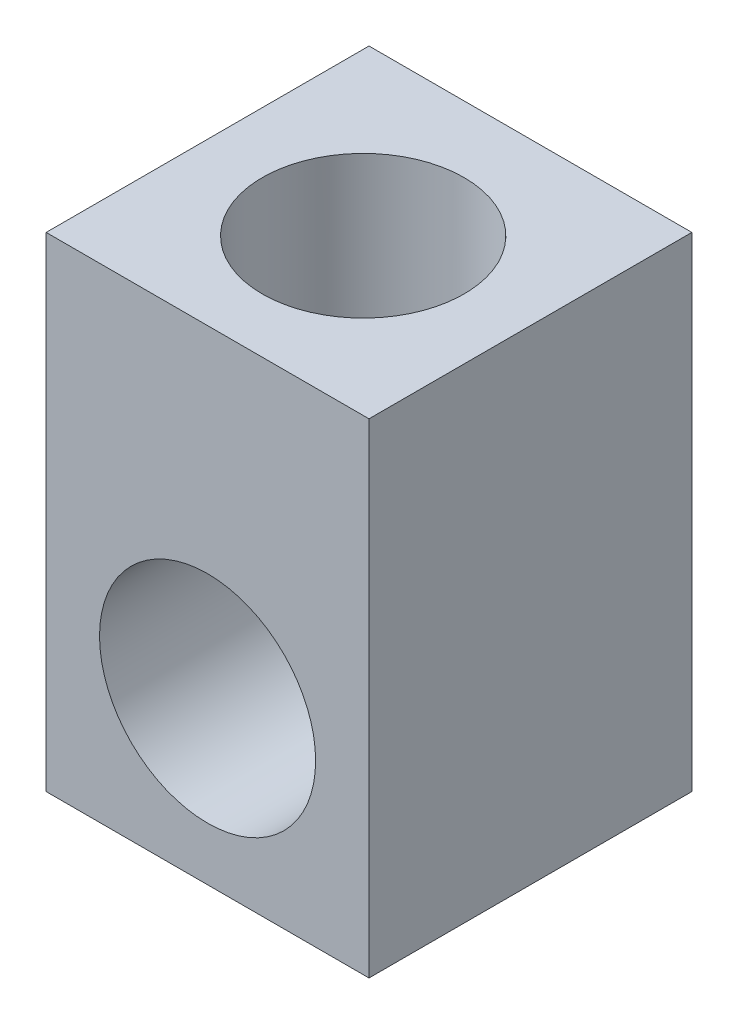
ISO-10303-21;
HEADER;
FILE_DESCRIPTION(('STEP AP214'),'2;1');
FILE_NAME('part.step','',(''),(''),'','','');
FILE_SCHEMA(('AUTOMOTIVE_DESIGN { 1 0 10303 214 1 1 1 1 }'));
ENDSEC;
DATA;
#1=APPLICATION_CONTEXT('core data for automotive mechanical design processes');
#2=APPLICATION_PROTOCOL_DEFINITION('international standard','automotive_design',2000,#1);
#3=PRODUCT_CONTEXT('',#1,'mechanical');
#4=PRODUCT('Part','Part','',(#3));
#5=PRODUCT_RELATED_PRODUCT_CATEGORY('part','',(#4));
#6=PRODUCT_DEFINITION_FORMATION('','',#4);
#7=PRODUCT_DEFINITION_CONTEXT('part definition',#1,'design');
#8=PRODUCT_DEFINITION('design','',#6,#7);
#9=PRODUCT_DEFINITION_SHAPE('','',#8);
#10=(LENGTH_UNIT() NAMED_UNIT(*) SI_UNIT(.MILLI.,.METRE.));
#11=(NAMED_UNIT(*) PLANE_ANGLE_UNIT() SI_UNIT($,.RADIAN.));
#12=(NAMED_UNIT(*) SI_UNIT($,.STERADIAN.) SOLID_ANGLE_UNIT());
#13=UNCERTAINTY_MEASURE_WITH_UNIT(LENGTH_MEASURE(1.E-05),#10,'distance_accuracy_value','');
#14=(GEOMETRIC_REPRESENTATION_CONTEXT(3) GLOBAL_UNCERTAINTY_ASSIGNED_CONTEXT((#13)) GLOBAL_UNIT_ASSIGNED_CONTEXT((#10,
#11,#12)) REPRESENTATION_CONTEXT('',''));
#15=CARTESIAN_POINT('',(0.,0.,0.));
#16=DIRECTION('',(0.,0.,1.));
#17=DIRECTION('',(1.,0.,0.));
#18=AXIS2_PLACEMENT_3D('',#15,#16,#17);
#19=CARTESIAN_POINT('',(0.,76.2,0.));
#20=DIRECTION('',(1.,0.,0.));
#21=DIRECTION('',(0.,0.,-1.));
#22=AXIS2_PLACEMENT_3D('',#19,#20,#21);
#23=PLANE('',#22);
#24=DIRECTION('',(0.,0.,1.));
#25=VECTOR('',#24,1.);
#26=CARTESIAN_POINT('',(0.,0.,0.));
#27=LINE('',#26,#25);
#28=CARTESIAN_POINT('',(0.,0.,-50.8));
#29=VERTEX_POINT('',#28);
#30=CARTESIAN_POINT('',(0.,0.,0.));
#31=VERTEX_POINT('',#30);
#32=EDGE_CURVE('E94',#29,#31,#27,.T.);
#33=ORIENTED_EDGE('',*,*,#32,.T.);
#34=DIRECTION('',(0.,-1.,0.));
#35=VECTOR('',#34,1.);
#36=CARTESIAN_POINT('',(0.,76.2,0.));
#37=LINE('',#36,#35);
#38=CARTESIAN_POINT('',(0.,76.2,0.));
#39=VERTEX_POINT('',#38);
#40=EDGE_CURVE('E11',#39,#31,#37,.T.);
#41=ORIENTED_EDGE('',*,*,#40,.F.);
#42=DIRECTION('',(0.,0.,1.));
#43=VECTOR('',#42,1.);
#44=CARTESIAN_POINT('',(0.,76.2,0.));
#45=LINE('',#44,#43);
#46=CARTESIAN_POINT('',(0.,76.2,-50.8));
#47=VERTEX_POINT('',#46);
#48=EDGE_CURVE('E82',#47,#39,#45,.T.);
#49=ORIENTED_EDGE('',*,*,#48,.F.);
#50=DIRECTION('',(0.,-1.,0.));
#51=VECTOR('',#50,1.);
#52=CARTESIAN_POINT('',(0.,76.2,-50.8));
#53=LINE('',#52,#51);
#54=EDGE_CURVE('E90',#47,#29,#53,.T.);
#55=ORIENTED_EDGE('',*,*,#54,.T.);
#56=EDGE_LOOP('',(#33,#41,#49,#55));
#57=FACE_BOUND('',#56,.T.);
#58=ADVANCED_FACE('F31',(#57),#23,.F.);
#59=CARTESIAN_POINT('',(0.,76.2,0.));
#60=DIRECTION('',(0.,0.,-1.));
#61=DIRECTION('',(-1.,0.,0.));
#62=AXIS2_PLACEMENT_3D('',#59,#60,#61);
#63=PLANE('',#62);
#64=CARTESIAN_POINT('',(25.4,25.4,0.));
#65=DIRECTION('',(0.,0.,-1.));
#66=DIRECTION('',(-1.,0.,0.));
#67=AXIS2_PLACEMENT_3D('',#64,#65,#66);
#68=CIRCLE('',#67,17.);
#69=CARTESIAN_POINT('',(8.4,25.4,0.));
#70=VERTEX_POINT('',#69);
#71=EDGE_CURVE('E97',#70,#70,#68,.T.);
#72=ORIENTED_EDGE('',*,*,#71,.T.);
#73=EDGE_LOOP('',(#72));
#74=FACE_BOUND('',#73,.T.);
#75=DIRECTION('',(1.,0.,0.));
#76=VECTOR('',#75,1.);
#77=CARTESIAN_POINT('',(0.,0.,0.));
#78=LINE('',#77,#76);
#79=CARTESIAN_POINT('',(50.8,0.,0.));
#80=VERTEX_POINT('',#79);
#81=EDGE_CURVE('E86',#31,#80,#78,.T.);
#82=ORIENTED_EDGE('',*,*,#81,.T.);
#83=DIRECTION('',(0.,-1.,0.));
#84=VECTOR('',#83,1.);
#85=CARTESIAN_POINT('',(50.8,76.2,0.));
#86=LINE('',#85,#84);
#87=CARTESIAN_POINT('',(50.8,76.2,0.));
#88=VERTEX_POINT('',#87);
#89=EDGE_CURVE('E39',#88,#80,#86,.T.);
#90=ORIENTED_EDGE('',*,*,#89,.F.);
#91=DIRECTION('',(1.,0.,0.));
#92=VECTOR('',#91,1.);
#93=CARTESIAN_POINT('',(0.,76.2,0.));
#94=LINE('',#93,#92);
#95=EDGE_CURVE('E77',#39,#88,#94,.T.);
#96=ORIENTED_EDGE('',*,*,#95,.F.);
#97=ORIENTED_EDGE('',*,*,#40,.T.);
#98=EDGE_LOOP('',(#82,#90,#96,#97));
#99=FACE_BOUND('',#98,.T.);
#100=ADVANCED_FACE('F85',(#74,#99),#63,.F.);
#101=CARTESIAN_POINT('',(50.8,76.2,0.));
#102=DIRECTION('',(-1.,0.,0.));
#103=DIRECTION('',(0.,0.,1.));
#104=AXIS2_PLACEMENT_3D('',#101,#102,#103);
#105=PLANE('',#104);
#106=DIRECTION('',(0.,0.,-1.));
#107=VECTOR('',#106,1.);
#108=CARTESIAN_POINT('',(50.8,0.,0.));
#109=LINE('',#108,#107);
#110=CARTESIAN_POINT('',(50.8,0.,-50.8));
#111=VERTEX_POINT('',#110);
#112=EDGE_CURVE('E64',#80,#111,#109,.T.);
#113=ORIENTED_EDGE('',*,*,#112,.T.);
#114=DIRECTION('',(0.,-1.,0.));
#115=VECTOR('',#114,1.);
#116=CARTESIAN_POINT('',(50.8,76.2,-50.8));
#117=LINE('',#116,#115);
#118=CARTESIAN_POINT('',(50.8,76.2,-50.8));
#119=VERTEX_POINT('',#118);
#120=EDGE_CURVE('E87',#119,#111,#117,.T.);
#121=ORIENTED_EDGE('',*,*,#120,.F.);
#122=DIRECTION('',(0.,0.,-1.));
#123=VECTOR('',#122,1.);
#124=CARTESIAN_POINT('',(50.8,76.2,0.));
#125=LINE('',#124,#123);
#126=EDGE_CURVE('E80',#88,#119,#125,.T.);
#127=ORIENTED_EDGE('',*,*,#126,.F.);
#128=ORIENTED_EDGE('',*,*,#89,.T.);
#129=EDGE_LOOP('',(#113,#121,#127,#128));
#130=FACE_BOUND('',#129,.T.);
#131=ADVANCED_FACE('F88',(#130),#105,.F.);
#132=CARTESIAN_POINT('',(0.,76.2,-50.8));
#133=DIRECTION('',(0.,0.,1.));
#134=DIRECTION('',(1.,0.,0.));
#135=AXIS2_PLACEMENT_3D('',#132,#133,#134);
#136=PLANE('',#135);
#137=CARTESIAN_POINT('',(25.4,25.4,-50.8));
#138=DIRECTION('',(0.,0.,-1.));
#139=DIRECTION('',(-1.,0.,0.));
#140=AXIS2_PLACEMENT_3D('',#137,#138,#139);
#141=CIRCLE('',#140,17.);
#142=CARTESIAN_POINT('',(8.4,25.4,-50.8));
#143=VERTEX_POINT('',#142);
#144=EDGE_CURVE('E110',#143,#143,#141,.T.);
#145=ORIENTED_EDGE('',*,*,#144,.F.);
#146=EDGE_LOOP('',(#145));
#147=FACE_BOUND('',#146,.T.);
#148=DIRECTION('',(-1.,0.,0.));
#149=VECTOR('',#148,1.);
#150=CARTESIAN_POINT('',(0.,0.,-50.8));
#151=LINE('',#150,#149);
#152=EDGE_CURVE('E70',#111,#29,#151,.T.);
#153=ORIENTED_EDGE('',*,*,#152,.T.);
#154=ORIENTED_EDGE('',*,*,#54,.F.);
#155=DIRECTION('',(-1.,0.,0.));
#156=VECTOR('',#155,1.);
#157=CARTESIAN_POINT('',(0.,76.2,-50.8));
#158=LINE('',#157,#156);
#159=EDGE_CURVE('E47',#119,#47,#158,.T.);
#160=ORIENTED_EDGE('',*,*,#159,.F.);
#161=ORIENTED_EDGE('',*,*,#120,.T.);
#162=EDGE_LOOP('',(#153,#154,#160,#161));
#163=FACE_BOUND('',#162,.T.);
#164=ADVANCED_FACE('F102',(#147,#163),#136,.F.);
#165=CARTESIAN_POINT('',(0.,76.2,-50.8));
#166=DIRECTION('',(0.,-1.,0.));
#167=DIRECTION('',(0.,0.,-1.));
#168=AXIS2_PLACEMENT_3D('',#165,#166,#167);
#169=PLANE('',#168);
#170=CARTESIAN_POINT('',(25.4,76.2,-24.4856236331401));
#171=DIRECTION('',(0.,1.,0.));
#172=DIRECTION('',(0.,0.,1.));
#173=AXIS2_PLACEMENT_3D('',#170,#171,#172);
#174=CIRCLE('',#173,15.875);
#175=CARTESIAN_POINT('',(25.4,76.2,-8.61062363314011));
#176=VERTEX_POINT('',#175);
#177=EDGE_CURVE('E113',#176,#176,#174,.T.);
#178=ORIENTED_EDGE('',*,*,#177,.F.);
#179=EDGE_LOOP('',(#178));
#180=FACE_BOUND('',#179,.T.);
#181=ORIENTED_EDGE('',*,*,#48,.T.);
#182=ORIENTED_EDGE('',*,*,#95,.T.);
#183=ORIENTED_EDGE('',*,*,#126,.T.);
#184=ORIENTED_EDGE('',*,*,#159,.T.);
#185=EDGE_LOOP('',(#181,#182,#183,#184));
#186=FACE_BOUND('',#185,.T.);
#187=ADVANCED_FACE('F78',(#180,#186),#169,.F.);
#188=CARTESIAN_POINT('',(0.,0.,-50.8));
#189=DIRECTION('',(0.,-1.,0.));
#190=DIRECTION('',(0.,0.,-1.));
#191=AXIS2_PLACEMENT_3D('',#188,#189,#190);
#192=PLANE('',#191);
#193=ORIENTED_EDGE('',*,*,#32,.F.);
#194=ORIENTED_EDGE('',*,*,#152,.F.);
#195=ORIENTED_EDGE('',*,*,#112,.F.);
#196=ORIENTED_EDGE('',*,*,#81,.F.);
#197=EDGE_LOOP('',(#193,#194,#195,#196));
#198=FACE_BOUND('',#197,.T.);
#199=ADVANCED_FACE('F105',(#198),#192,.T.);
#200=CARTESIAN_POINT('',(25.4,25.4,25.4));
#201=DIRECTION('',(0.,0.,-1.));
#202=DIRECTION('',(-1.,0.,0.));
#203=AXIS2_PLACEMENT_3D('',#200,#201,#202);
#204=CYLINDRICAL_SURFACE('',#203,17.);
#205=CARTESIAN_POINT('',(25.4,42.4,-8.61062363314011));
#206=CARTESIAN_POINT('',(25.0366266977627,42.3999989105498,-8.61062473301476));
#207=CARTESIAN_POINT('',(24.6732384414275,42.3883260528731,-8.6231229648808));
#208=CARTESIAN_POINT('',(23.9496434345601,42.3418987721633,-8.67285545206848));
#209=CARTESIAN_POINT('',(23.5894368726679,42.307142989748,-8.710091164211));
#210=CARTESIAN_POINT('',(22.8750392121792,42.2153010561053,-8.80856109902749));
#211=CARTESIAN_POINT('',(22.5208512556375,42.1582035936275,-8.8698074779641));
#212=CARTESIAN_POINT('',(21.8213369257011,42.022878871078,-9.01512179284696));
#213=CARTESIAN_POINT('',(21.4760106316715,41.9446514218382,-9.09918993310723));
#214=CARTESIAN_POINT('',(20.79861041808,41.7691438396201,-9.28806775414502));
#215=CARTESIAN_POINT('',(20.4664658649705,41.6719887638284,-9.39274133722168));
#216=CARTESIAN_POINT('',(19.8148213921091,41.4599873933943,-9.62155043903515));
#217=CARTESIAN_POINT('',(19.4953211753405,41.3451415146213,-9.74568550027946));
#218=CARTESIAN_POINT('',(18.8702073040842,41.0995091879706,-10.0117564998633));
#219=CARTESIAN_POINT('',(18.5645934377233,40.9687229834171,-10.1536921664831));
#220=CARTESIAN_POINT('',(17.968049250634,40.6929444272239,-10.4537574809384));
#221=CARTESIAN_POINT('',(17.6771223090354,40.54794882869,-10.6118908303738));
#222=CARTESIAN_POINT('',(16.9958847396493,40.1842568632254,-11.0097643023263));
#223=CARTESIAN_POINT('',(16.6129666137973,39.9594700788478,-11.2566433859677));
#224=CARTESIAN_POINT('',(15.8778000976667,39.4896481709275,-11.7755507654684));
#225=CARTESIAN_POINT('',(15.5255630326207,39.2446056349288,-12.0475882722479));
#226=CARTESIAN_POINT('',(14.8507769072314,38.7376332541857,-12.6144711956339));
#227=CARTESIAN_POINT('',(14.5283183239014,38.4756558060124,-12.9093814160569));
#228=CARTESIAN_POINT('',(13.913871259842,37.939345919268,-13.5187779208917));
#229=CARTESIAN_POINT('',(13.6218796656822,37.6650147472372,-13.8332621997707));
#230=CARTESIAN_POINT('',(12.9956438392124,37.0351555800355,-14.5641514605782));
#231=CARTESIAN_POINT('',(12.6701046982102,36.6770343818458,-14.9858235646922));
#232=CARTESIAN_POINT('',(12.216225333696,36.135164617202,-15.638369113158));
#233=CARTESIAN_POINT('',(12.0706061959393,35.95366803189,-15.8593394663386));
#234=CARTESIAN_POINT('',(11.7907398840329,35.5902208269848,-16.3079967975649));
#235=CARTESIAN_POINT('',(11.6564915015134,35.4082702577573,-16.5356830584356));
#236=CARTESIAN_POINT('',(11.3995844214461,35.045601551225,-16.9973914797502));
#237=CARTESIAN_POINT('',(11.276898582762,34.8648815008803,-17.2313970552323));
#238=CARTESIAN_POINT('',(11.0427318615341,34.5057552677662,-17.7066378211845));
#239=CARTESIAN_POINT('',(10.9312495495635,34.3273487923504,-17.9478720842551));
#240=CARTESIAN_POINT('',(10.7196440832249,33.9749252900046,-18.4379829335474));
#241=CARTESIAN_POINT('',(10.6195092418645,33.8009038931621,-18.6868513151904));
#242=CARTESIAN_POINT('',(10.4306811574177,33.4596194531848,-19.1933487170267));
#243=CARTESIAN_POINT('',(10.3419844547623,33.292354377101,-19.4509750583651));
#244=CARTESIAN_POINT('',(10.2006708343764,33.0155760069351,-19.8993507854188));
#245=CARTESIAN_POINT('',(10.1450960603904,32.9034984407005,-20.0875834593947));
#246=CARTESIAN_POINT('',(10.0400941012049,32.6861404531658,-20.4696327530224));
#247=CARTESIAN_POINT('',(9.99066688833327,32.5808600012708,-20.6634493475345));
#248=CARTESIAN_POINT('',(9.89833978163158,32.3793127151967,-21.0570744069252));
#249=CARTESIAN_POINT('',(9.8554342409515,32.2830381113254,-21.2568775067784));
#250=CARTESIAN_POINT('',(9.77658799195357,32.1021435937147,-21.6629515876947));
#251=CARTESIAN_POINT('',(9.74064601103117,32.0175215512654,-21.8692213789365));
#252=CARTESIAN_POINT('',(9.65703679216498,31.8169336470218,-22.4145062227674));
#253=CARTESIAN_POINT('',(9.61523974588825,31.7125499509462,-22.7590346320388));
#254=CARTESIAN_POINT('',(9.56943657800511,31.5963690025146,-23.2856427192451));
#255=CARTESIAN_POINT('',(9.55698822080718,31.5643861110373,-23.4626359347724));
#256=CARTESIAN_POINT('',(9.53799873338729,31.5153593179567,-23.8190410386385));
#257=CARTESIAN_POINT('',(9.53145713098429,31.4983142222417,-23.9984527324824));
#258=CARTESIAN_POINT('',(9.52446737517064,31.4800958185255,-24.3594653481544));
#259=CARTESIAN_POINT('',(9.52406212946329,31.4790342737871,-24.5410728068773));
#260=CARTESIAN_POINT('',(9.5294670550717,31.4931303189833,-24.9035567183628));
#261=CARTESIAN_POINT('',(9.5352773466214,31.5082882226685,-25.0844331569165));
#262=CARTESIAN_POINT('',(9.55294403066261,31.5539748859255,-25.4442468491096));
#263=CARTESIAN_POINT('',(9.56481166819308,31.5845322321455,-25.6231798616951));
#264=CARTESIAN_POINT('',(9.59427132999735,31.6594370434413,-25.9776816942679));
#265=CARTESIAN_POINT('',(9.61186585259577,31.7037905266365,-26.1532490105277));
#266=CARTESIAN_POINT('',(9.66131900570755,31.8265073242357,-26.5767676483903));
#267=CARTESIAN_POINT('',(9.69604687611877,31.9112453868721,-26.8225334020245));
#268=CARTESIAN_POINT('',(9.775456010165,32.0995558232787,-27.3050467398437));
#269=CARTESIAN_POINT('',(9.82014345908858,32.2031398937843,-27.541788612387));
#270=CARTESIAN_POINT('',(9.91873914886992,32.4246215497272,-28.0074132711703));
#271=CARTESIAN_POINT('',(9.97267782841777,32.5425660001242,-28.2362670191167));
#272=CARTESIAN_POINT('',(10.0890600413427,32.7887533235239,-28.686190296063));
#273=CARTESIAN_POINT('',(10.1515069592535,32.9170002864394,-28.9072566830232));
#274=CARTESIAN_POINT('',(10.2894551843566,33.1908063169586,-29.3586993717107));
#275=CARTESIAN_POINT('',(10.3655841749422,33.3369424718934,-29.5885312708907));
#276=CARTESIAN_POINT('',(10.5268345902277,33.6351503022164,-30.0410031322464));
#277=CARTESIAN_POINT('',(10.6119550369849,33.7872213309746,-30.2636438731257));
#278=CARTESIAN_POINT('',(10.7911007155406,34.0955088060888,-30.7026927613512));
#279=CARTESIAN_POINT('',(10.8851337854547,34.2517288126814,-30.9190952002674));
#280=CARTESIAN_POINT('',(11.0819665874932,34.5667033920076,-31.3460002333113));
#281=CARTESIAN_POINT('',(11.1847672905768,34.7254582438727,-31.5565021705576));
#282=CARTESIAN_POINT('',(11.5065928796965,35.2041324966451,-32.1803140603727));
#283=CARTESIAN_POINT('',(11.7388137634076,35.5260638020006,-32.5853750012671));
#284=CARTESIAN_POINT('',(12.2386318812369,36.1677290006498,-33.3744883946764));
#285=CARTESIAN_POINT('',(12.5062162128579,36.4874636508564,-33.7585484375455));
#286=CARTESIAN_POINT('',(13.1022759636185,37.1464862199334,-34.5376066421796));
#287=CARTESIAN_POINT('',(13.4340083634626,37.4850923891164,-34.930707193139));
#288=CARTESIAN_POINT('',(14.141550868857,38.1468497667583,-35.6897398520819));
#289=CARTESIAN_POINT('',(14.5173753951312,38.4699958699455,-36.0556630071966));
#290=CARTESIAN_POINT('',(15.3128132144509,39.0931693834317,-36.7552469022698));
#291=CARTESIAN_POINT('',(15.7322748344199,39.3932709599727,-37.0890121057856));
#292=CARTESIAN_POINT('',(16.3948145243312,39.821365099414,-37.5621621620675));
#293=CARTESIAN_POINT('',(16.6211590768054,39.9603552364845,-37.7152615432306));
#294=CARTESIAN_POINT('',(17.08502236094,40.2301426660116,-38.0116181573731));
#295=CARTESIAN_POINT('',(17.3225432789082,40.3609383437125,-38.1548734510652));
#296=CARTESIAN_POINT('',(17.8632573905732,40.641720064519,-38.4616850152809));
#297=CARTESIAN_POINT('',(18.1691946704454,40.7893950204443,-38.6225484807857));
#298=CARTESIAN_POINT('',(18.7967166853471,41.0689048590286,-38.9263209994618));
#299=CARTESIAN_POINT('',(19.1182964840745,41.2007446937889,-39.0692356663841));
#300=CARTESIAN_POINT('',(19.7760107950953,41.4466175347272,-39.3352747709407));
#301=CARTESIAN_POINT('',(20.1121396994205,41.5606573252402,-39.4584067491054));
#302=CARTESIAN_POINT('',(20.7975252713661,41.7690409981235,-39.6830870028943));
#303=CARTESIAN_POINT('',(21.1467823809962,41.8633842166333,-39.784634551031));
#304=CARTESIAN_POINT('',(21.8591605950619,42.0312178069069,-39.9650984346531));
#305=CARTESIAN_POINT('',(22.2223700450245,42.1045358954259,-40.043827847792));
#306=CARTESIAN_POINT('',(22.9573039735712,42.227716278612,-40.1760103605329));
#307=CARTESIAN_POINT('',(23.3290284258692,42.277578645677,-40.2294635381519));
#308=CARTESIAN_POINT('',(24.0776167366956,42.3526614213216,-40.3099265780093));
#309=CARTESIAN_POINT('',(24.4544778722115,42.3778944076331,-40.3369499374411));
#310=CARTESIAN_POINT('',(25.2099940542132,42.4031381841391,-40.3639849415907));
#311=CARTESIAN_POINT('',(25.588648909454,42.4031516052784,-40.3639994039191));
#312=CARTESIAN_POINT('',(26.3003331752599,42.37943241434,-40.3385969979208));
#313=CARTESIAN_POINT('',(26.6335667610628,42.3584503302348,-40.3161258661493));
#314=CARTESIAN_POINT('',(27.2961679545168,42.2971955890805,-40.2504891082923));
#315=CARTESIAN_POINT('',(27.6255359146931,42.256924705297,-40.2073253845261));
#316=CARTESIAN_POINT('',(28.2782091037931,42.1578307872492,-40.1010290680527));
#317=CARTESIAN_POINT('',(28.6015137823569,42.0990060774195,-40.0378946718256));
#318=CARTESIAN_POINT('',(29.2400858940673,41.9638241388845,-39.8926544922463));
#319=CARTESIAN_POINT('',(29.555352941457,41.8874660704393,-39.8105478002366));
#320=CARTESIAN_POINT('',(30.1797852461445,41.7174622118017,-39.6274981123467));
#321=CARTESIAN_POINT('',(30.4888381475615,41.6236271403898,-39.5263487347557));
#322=CARTESIAN_POINT('',(31.0956915161866,41.4206579335745,-39.30718946727));
#323=CARTESIAN_POINT('',(31.3934922473323,41.3115241573098,-39.1891799731669));
#324=CARTESIAN_POINT('',(31.9768766587319,41.0793894978179,-38.9376555321772));
#325=CARTESIAN_POINT('',(32.2624598892754,40.9563881047464,-38.8041400152046));
#326=CARTESIAN_POINT('',(32.8207499022863,40.6979457572743,-38.5229253148799));
#327=CARTESIAN_POINT('',(33.093453933432,40.562502162943,-38.3752231211578));
#328=CARTESIAN_POINT('',(33.7574850452102,40.2106458583198,-37.99042282055));
#329=CARTESIAN_POINT('',(34.1405835186973,39.9873853528572,-37.7453124509626));
#330=CARTESIAN_POINT('',(34.8763008460972,39.520542544647,-37.2299272813608));
#331=CARTESIAN_POINT('',(35.2289069521474,39.2769518253323,-36.959642053705));
#332=CARTESIAN_POINT('',(35.9046538735887,38.7727510279959,-36.3962070345045));
#333=CARTESIAN_POINT('',(36.2276986701731,38.5120899005104,-36.1029880989427));
#334=CARTESIAN_POINT('',(36.8434409806295,37.978303997767,-35.4969762907714));
#335=CARTESIAN_POINT('',(37.1361418353657,37.7051805993822,-35.1841855791059));
#336=CARTESIAN_POINT('',(37.7652543816614,37.0767569564073,-34.4558265593033));
#337=CARTESIAN_POINT('',(38.0928424440892,36.7187770549281,-34.0349045395054));
#338=CARTESIAN_POINT('',(38.5497083294252,36.1768802917483,-33.3834404835937));
#339=CARTESIAN_POINT('',(38.6963084485601,35.9953355360794,-33.1628244460617));
#340=CARTESIAN_POINT('',(38.9781117350702,35.6317031349804,-32.7148724709453));
#341=CARTESIAN_POINT('',(39.113316111958,35.4496155492941,-32.4875372499846));
#342=CARTESIAN_POINT('',(39.3721085010702,35.0865761877013,-32.0265464491789));
#343=CARTESIAN_POINT('',(39.4957239732801,34.9056227262872,-31.7929075909242));
#344=CARTESIAN_POINT('',(39.7317349831672,34.5459074334853,-31.3184272736553));
#345=CARTESIAN_POINT('',(39.8441319272248,34.3671453298548,-31.0775867223936));
#346=CARTESIAN_POINT('',(40.0575612706612,34.0138516007639,-30.5883032355251));
#347=CARTESIAN_POINT('',(40.1586050714013,33.8393158717356,-30.3398682514845));
#348=CARTESIAN_POINT('',(40.3492553921269,33.4967969359498,-29.8343039322185));
#349=CARTESIAN_POINT('',(40.4388652667579,33.3288118173727,-29.5771771752424));
#350=CARTESIAN_POINT('',(40.5819170480896,33.0502488303443,-29.1292258290246));
#351=CARTESIAN_POINT('',(40.6382953253099,32.9371912421315,-28.9408823860297));
#352=CARTESIAN_POINT('',(40.7448895807607,32.7177339024644,-28.5586297106529));
#353=CARTESIAN_POINT('',(40.7951056158585,32.6113340895744,-28.3647205296536));
#354=CARTESIAN_POINT('',(40.8890101180329,32.4073647026774,-27.9708933359455));
#355=CARTESIAN_POINT('',(40.9327033464209,32.3097887084551,-27.7709798353905));
#356=CARTESIAN_POINT('',(41.0131253983006,32.1260960026149,-27.3646694122263));
#357=CARTESIAN_POINT('',(41.049855422655,32.0399773158542,-27.1582736147131));
#358=CARTESIAN_POINT('',(41.1357461011777,31.8346820548442,-26.6111816609835));
#359=CARTESIAN_POINT('',(41.1789626514974,31.7270726740868,-26.2648538633506));
#360=CARTESIAN_POINT('',(41.2267407146453,31.6061387969899,-25.7351598034109));
#361=CARTESIAN_POINT('',(41.2398208847933,31.5725879827177,-25.5570831515699));
#362=CARTESIAN_POINT('',(41.2600078907487,31.5205343071877,-25.1983601832487));
#363=CARTESIAN_POINT('',(41.2671152369702,31.5020301601053,-25.0177140876851));
#364=CARTESIAN_POINT('',(41.2751579300388,31.4810767631967,-24.6539588737264));
#365=CARTESIAN_POINT('',(41.2760457070172,31.478751255312,-24.470841482122));
#366=CARTESIAN_POINT('',(41.2714949095757,31.4906228009287,-24.1052288643197));
#367=CARTESIAN_POINT('',(41.2660562433229,31.5048200942704,-23.9227336471918));
#368=CARTESIAN_POINT('',(41.2490147560677,31.548925107258,-23.5596309307943));
#369=CARTESIAN_POINT('',(41.2374005367593,31.5788618763279,-23.3790275539139));
#370=CARTESIAN_POINT('',(41.2083307619055,31.6528592686706,-23.0211906184047));
#371=CARTESIAN_POINT('',(41.19087263631,31.6969261057461,-22.8439585787381));
#372=CARTESIAN_POINT('',(41.1420703815086,31.8181831258477,-22.4203438444674));
#373=CARTESIAN_POINT('',(41.1079724260215,31.9015184466003,-22.1760416786503));
#374=CARTESIAN_POINT('',(41.0299273548205,32.0869627904667,-21.6963294912356));
#375=CARTESIAN_POINT('',(40.9859743273832,32.1890830754121,-21.4609249064554));
#376=CARTESIAN_POINT('',(40.888946215124,32.4076307887438,-20.9978870345397));
#377=CARTESIAN_POINT('',(40.8358410189509,32.5241050705737,-20.7702824715068));
#378=CARTESIAN_POINT('',(40.7212211092794,32.7673796466778,-20.3227905603234));
#379=CARTESIAN_POINT('',(40.659703039053,32.894184054455,-20.1029063368141));
#380=CARTESIAN_POINT('',(40.5237447661406,33.165115438689,-19.6537388537237));
#381=CARTESIAN_POINT('',(40.4486794730332,33.3098273828078,-19.4250002657569));
#382=CARTESIAN_POINT('',(40.289661977434,33.6052497565615,-18.9746713750636));
#383=CARTESIAN_POINT('',(40.2057107375528,33.7559595353522,-18.7530803014365));
#384=CARTESIAN_POINT('',(40.0290142059549,34.0615892753463,-18.3160886782448));
#385=CARTESIAN_POINT('',(39.9362611377228,34.2165128716702,-18.1006938261917));
#386=CARTESIAN_POINT('',(39.742102749331,34.5289628597084,-17.6757590420794));
#387=CARTESIAN_POINT('',(39.6406964677872,34.686489539057,-17.4662197640246));
#388=CARTESIAN_POINT('',(39.3232366580834,35.161582651955,-16.8452243924351));
#389=CARTESIAN_POINT('',(39.0941666993703,35.4812675142518,-16.4419435574523));
#390=CARTESIAN_POINT('',(38.601158904294,36.1187675938611,-15.6561308945755));
#391=CARTESIAN_POINT('',(38.3372338674224,36.4365834529743,-15.2735915223851));
#392=CARTESIAN_POINT('',(37.7484041968895,37.0930870906529,-14.496073950981));
#393=CARTESIAN_POINT('',(37.4201576047285,37.4311013286827,-14.103040165693));
#394=CARTESIAN_POINT('',(36.7199694052893,38.0921361486364,-13.3437797865956));
#395=CARTESIAN_POINT('',(36.3480135669552,38.4151517992296,-12.9775619869992));
#396=CARTESIAN_POINT('',(35.5606163244462,39.0386612085032,-12.2768505752052));
#397=CARTESIAN_POINT('',(35.1453189082451,39.3392241865752,-11.9422585391822));
#398=CARTESIAN_POINT('',(34.48923910773,39.7685084550007,-11.4673983312406));
#399=CARTESIAN_POINT('',(34.2650820218372,39.9079785874211,-11.313650297885));
#400=CARTESIAN_POINT('',(33.80565445647,40.1789068989719,-11.0158222246361));
#401=CARTESIAN_POINT('',(33.5703817685859,40.3103634740137,-10.8717441198115));
#402=CARTESIAN_POINT('',(33.0322918683575,40.5941145862901,-10.5614880852705));
#403=CARTESIAN_POINT('',(32.7266058809278,40.7440356533969,-10.398085332395));
#404=CARTESIAN_POINT('',(32.0993504308352,41.0280897105658,-10.0892182188362));
#405=CARTESIAN_POINT('',(31.7777859707451,41.1622276286797,-9.9437482582272));
#406=CARTESIAN_POINT('',(31.1199651889289,41.4126746839211,-9.67265414425571));
#407=CARTESIAN_POINT('',(30.7837202073713,41.5289972802292,-9.54701500681759));
#408=CARTESIAN_POINT('',(30.0978396147881,41.7419459083983,-9.31734514772478));
#409=CARTESIAN_POINT('',(29.7482048554658,41.8385731905843,-9.21331305437403));
#410=CARTESIAN_POINT('',(29.0729897709078,42.0017318168768,-9.03783872282453));
#411=CARTESIAN_POINT('',(28.7484766524644,42.0703008699473,-8.96418395941953));
#412=CARTESIAN_POINT('',(28.0921803829524,42.188785528014,-8.83699813872149));
#413=CARTESIAN_POINT('',(27.760397891401,42.2387028178417,-8.78346526379652));
#414=CARTESIAN_POINT('',(27.0918237827956,42.3189555659262,-8.69743428219386));
#415=CARTESIAN_POINT('',(26.7550331468828,42.3492948093144,-8.66493210953152));
#416=CARTESIAN_POINT('',(26.0788327977345,42.3898181626023,-8.62152559897367));
#417=CARTESIAN_POINT('',(25.7394229227557,42.4000010176432,-8.61062260575955));
#418=CARTESIAN_POINT('',(25.4,42.4,-8.61062363314011));
#419=B_SPLINE_CURVE_WITH_KNOTS('',3,(#205,#206,#207,#208,#209,#210,#211,#212,#213,#214,#215,
#216,#217,#218,#219,#220,#221,#222,#223,#224,#225,#226,#227,#228,#229,#230,#231,#232,#233,#234,
#235,#236,#237,#238,#239,#240,#241,#242,#243,#244,#245,#246,#247,#248,#249,#250,#251,#252,#253,
#254,#255,#256,#257,#258,#259,#260,#261,#262,#263,#264,#265,#266,#267,#268,#269,#270,#271,#272,
#273,#274,#275,#276,#277,#278,#279,#280,#281,#282,#283,#284,#285,#286,#287,#288,#289,#290,#291,
#292,#293,#294,#295,#296,#297,#298,#299,#300,#301,#302,#303,#304,#305,#306,#307,#308,#309,#310,
#311,#312,#313,#314,#315,#316,#317,#318,#319,#320,#321,#322,#323,#324,#325,#326,#327,#328,#329,
#330,#331,#332,#333,#334,#335,#336,#337,#338,#339,#340,#341,#342,#343,#344,#345,#346,#347,#348,
#349,#350,#351,#352,#353,#354,#355,#356,#357,#358,#359,#360,#361,#362,#363,#364,#365,#366,#367,
#368,#369,#370,#371,#372,#373,#374,#375,#376,#377,#378,#379,#380,#381,#382,#383,#384,#385,#386,
#387,#388,#389,#390,#391,#392,#393,#394,#395,#396,#397,#398,#399,#400,#401,#402,#403,#404,#405,
#406,#407,#408,#409,#410,#411,#412,#413,#414,#415,#416,#417,#418),.UNSPECIFIED.,.T.,.F.,(4,2,2,
2,2,2,2,2,2,2,2,2,2,2,2,2,2,2,2,2,2,2,2,2,2,2,2,2,2,2,2,2,2,2,2,2,2,2,2,2,2,2,2,2,2,2,2,2,2,2,2,
2,2,2,2,2,2,2,2,2,2,2,2,2,2,2,2,2,2,2,2,2,2,2,2,2,2,2,2,2,2,2,2,2,2,2,2,2,2,2,2,2,2,2,2,2,2,2,2,
2,2,2,2,2,2,2,4),(0.,1.08974807371872,2.17956032974259,3.26992505641309,4.36029954500053,
5.44370021428403,6.52707541924311,7.61043408888299,8.69404088939884,10.2159002023241,
11.7383189160246,13.2652207156357,14.7919663275798,16.7149982961323,17.6774780800865,
18.6398554526815,19.5999143996062,20.5598506993648,21.518789178856,22.4774369350091,
23.1552613762368,23.8330827662521,24.5103138735252,25.1874210984663,26.2700637245231,
26.8103243037631,27.350541691199,27.8945347502249,28.4385383324938,28.98355551255,
29.528810772972,30.3142748028679,31.1002280027622,31.8888185986341,32.6777238127196,
33.5257687173015,34.3737214803005,35.2224270110592,36.0712266528616,37.7709800069441,
39.4701149024607,41.3153069754991,43.1611042263393,45.0006876464573,45.9200263282575,
46.8395456038095,47.9661278742216,49.0923569072822,50.2181556340166,51.3439922989607,
52.4788065799383,53.6136173582035,54.7478483076381,55.8819609323061,56.8846994990421,
57.8873458993068,58.8900828728532,59.8928678813533,60.9072217759296,61.9215518624309,
62.9359192530465,63.9505023669061,65.4681589227494,66.9864469244151,68.5095033682967,
70.0323919453616,71.9568171816902,72.9199865662168,73.8830535935414,74.8437776799464,
75.8043811761063,76.7640112000459,77.7233590236959,78.4035213667898,79.0836774326498,
79.7633345663669,80.4428743807048,81.5339712085482,82.078400569882,82.6227834016941,
83.1713253998679,83.7198753606217,84.2694413203278,84.819249287973,85.5990078123403,
86.3792353447772,87.1620806806825,87.9452392873792,88.7875560941541,89.6297817463439,
90.4727585681463,91.3158291680921,93.0041112005331,94.6917749765849,96.5302873210072,
98.3693999238636,100.202586260517,101.118734529982,102.035065588417,103.166973738949,
104.29852752497,105.429222178537,106.559845029418,107.577991984357,108.596046946865,
109.613905024191,110.631826467433),.UNSPECIFIED.);
#420=CARTESIAN_POINT('',(25.4,42.4,-8.61062363314011));
#421=VERTEX_POINT('',#420);
#422=EDGE_CURVE('E116',#421,#421,#419,.T.);
#423=ORIENTED_EDGE('',*,*,#422,.F.);
#424=EDGE_LOOP('',(#423));
#425=FACE_BOUND('',#424,.T.);
#426=ORIENTED_EDGE('',*,*,#144,.T.);
#427=EDGE_LOOP('',(#426));
#428=FACE_BOUND('',#427,.T.);
#429=ORIENTED_EDGE('',*,*,#71,.F.);
#430=EDGE_LOOP('',(#429));
#431=FACE_BOUND('',#430,.T.);
#432=ADVANCED_FACE('F127',(#425,#428,#431),#204,.F.);
#433=CARTESIAN_POINT('',(25.4,-0.001000000000001,-24.4856236331401));
#434=DIRECTION('',(0.,1.,0.));
#435=DIRECTION('',(0.,0.,1.));
#436=AXIS2_PLACEMENT_3D('',#433,#434,#435);
#437=CYLINDRICAL_SURFACE('',#436,15.875);
#438=ORIENTED_EDGE('',*,*,#177,.T.);
#439=EDGE_LOOP('',(#438));
#440=FACE_BOUND('',#439,.T.);
#441=ORIENTED_EDGE('',*,*,#422,.T.);
#442=EDGE_LOOP('',(#441));
#443=FACE_BOUND('',#442,.T.);
#444=ADVANCED_FACE('F122',(#440,#443),#437,.F.);
#445=CLOSED_SHELL('',(#58,#100,#131,#164,#187,#199,#432,#444));
#446=MANIFOLD_SOLID_BREP('B2',#445);
#447=ADVANCED_BREP_SHAPE_REPRESENTATION('',(#18,#446),#14);
#448=SHAPE_DEFINITION_REPRESENTATION(#9,#447);
ENDSEC;
END-ISO-10303-21;
